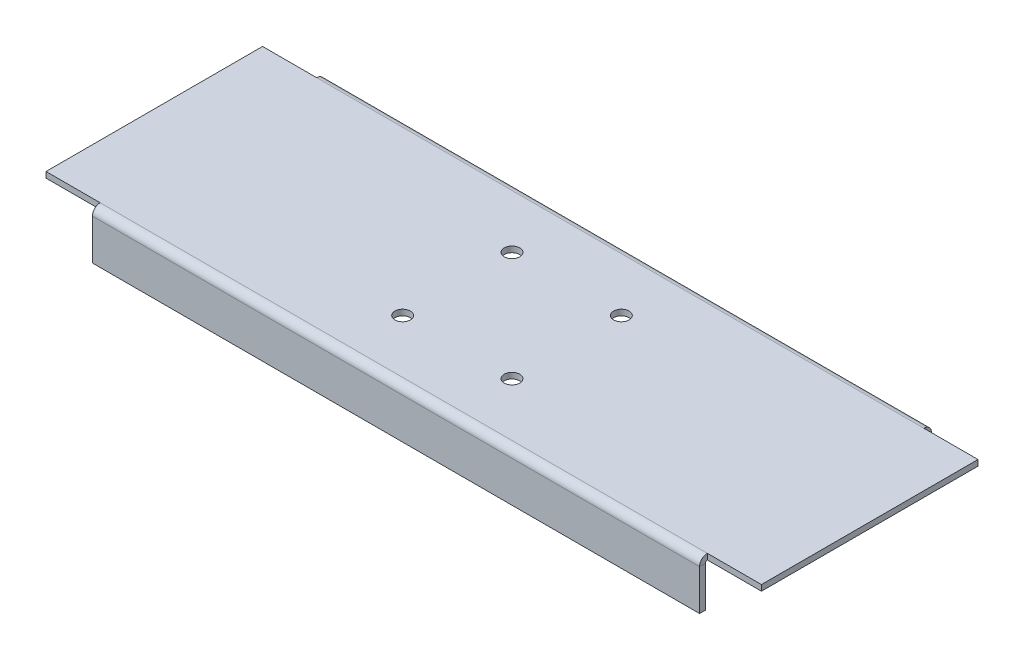
ISO-10303-21;
HEADER;
FILE_DESCRIPTION(('STEP AP214'),'2;1');
FILE_NAME('part.step','',(''),(''),'','','');
FILE_SCHEMA(('AUTOMOTIVE_DESIGN { 1 0 10303 214 1 1 1 1 }'));
ENDSEC;
DATA;
#1=APPLICATION_CONTEXT('core data for automotive mechanical design processes');
#2=APPLICATION_PROTOCOL_DEFINITION('international standard','automotive_design',2000,#1);
#3=PRODUCT_CONTEXT('',#1,'mechanical');
#4=PRODUCT('Part','Part','',(#3));
#5=PRODUCT_RELATED_PRODUCT_CATEGORY('part','',(#4));
#6=PRODUCT_DEFINITION_FORMATION('','',#4);
#7=PRODUCT_DEFINITION_CONTEXT('part definition',#1,'design');
#8=PRODUCT_DEFINITION('design','',#6,#7);
#9=PRODUCT_DEFINITION_SHAPE('','',#8);
#10=(LENGTH_UNIT() NAMED_UNIT(*) SI_UNIT(.MILLI.,.METRE.));
#11=(NAMED_UNIT(*) PLANE_ANGLE_UNIT() SI_UNIT($,.RADIAN.));
#12=(NAMED_UNIT(*) SI_UNIT($,.STERADIAN.) SOLID_ANGLE_UNIT());
#13=UNCERTAINTY_MEASURE_WITH_UNIT(LENGTH_MEASURE(1.E-05),#10,'distance_accuracy_value','');
#14=(GEOMETRIC_REPRESENTATION_CONTEXT(3) GLOBAL_UNCERTAINTY_ASSIGNED_CONTEXT((#13)) GLOBAL_UNIT_ASSIGNED_CONTEXT((#10,
#11,#12)) REPRESENTATION_CONTEXT('',''));
#15=CARTESIAN_POINT('',(0.,0.,0.));
#16=DIRECTION('',(0.,0.,1.));
#17=DIRECTION('',(1.,0.,0.));
#18=AXIS2_PLACEMENT_3D('',#15,#16,#17);
#19=CARTESIAN_POINT('',(-185.,-1.,56.));
#20=DIRECTION('',(-1.,0.,0.));
#21=DIRECTION('',(0.,0.,1.));
#22=AXIS2_PLACEMENT_3D('',#19,#20,#21);
#23=CYLINDRICAL_SURFACE('',#22,3.99999999999999);
#24=DIRECTION('',(-1.,0.,0.));
#25=VECTOR('',#24,1.);
#26=CARTESIAN_POINT('',(-185.,2.99999999999999,56.));
#27=LINE('',#26,#25);
#28=CARTESIAN_POINT('',(-157.,2.99999999999999,56.));
#29=VERTEX_POINT('',#28);
#30=CARTESIAN_POINT('',(157.,2.99999999999999,56.));
#31=VERTEX_POINT('',#30);
#32=EDGE_CURVE('E185',#29,#31,#27,.F.);
#33=ORIENTED_EDGE('',*,*,#32,.F.);
#34=CARTESIAN_POINT('',(-157.,-1.00000000000001,56.));
#35=DIRECTION('',(1.,0.,0.));
#36=DIRECTION('',(0.,0.,-1.));
#37=AXIS2_PLACEMENT_3D('',#34,#35,#36);
#38=CIRCLE('',#37,4.);
#39=CARTESIAN_POINT('',(-157.,-1.00000000000004,60.));
#40=VERTEX_POINT('',#39);
#41=EDGE_CURVE('E330',#29,#40,#38,.T.);
#42=ORIENTED_EDGE('',*,*,#41,.T.);
#43=DIRECTION('',(-1.,0.,0.));
#44=VECTOR('',#43,1.);
#45=CARTESIAN_POINT('',(0.,-1.,60.));
#46=LINE('',#45,#44);
#47=CARTESIAN_POINT('',(157.,-0.999999999999995,60.));
#48=VERTEX_POINT('',#47);
#49=EDGE_CURVE('E168',#48,#40,#46,.T.);
#50=ORIENTED_EDGE('',*,*,#49,.F.);
#51=CARTESIAN_POINT('',(157.,-1.00000000000001,56.));
#52=DIRECTION('',(-1.,0.,0.));
#53=DIRECTION('',(0.,0.,1.));
#54=AXIS2_PLACEMENT_3D('',#51,#52,#53);
#55=CIRCLE('',#54,4.);
#56=EDGE_CURVE('E383',#48,#31,#55,.T.);
#57=ORIENTED_EDGE('',*,*,#56,.T.);
#58=EDGE_LOOP('',(#33,#42,#50,#57));
#59=FACE_BOUND('',#58,.T.);
#60=ADVANCED_FACE('F38',(#59),#23,.T.);
#61=CARTESIAN_POINT('',(-185.,-1.,56.));
#62=DIRECTION('',(-1.,0.,0.));
#63=DIRECTION('',(0.,0.,1.));
#64=AXIS2_PLACEMENT_3D('',#61,#62,#63);
#65=CYLINDRICAL_SURFACE('',#64,0.999999999999994);
#66=CARTESIAN_POINT('',(-157.,-1.00000000000001,56.));
#67=DIRECTION('',(1.,0.,0.));
#68=DIRECTION('',(0.,0.,-1.));
#69=AXIS2_PLACEMENT_3D('',#66,#67,#68);
#70=CIRCLE('',#69,1.);
#71=CARTESIAN_POINT('',(-157.,0.,56.));
#72=VERTEX_POINT('',#71);
#73=CARTESIAN_POINT('',(-157.,-1.00000000000004,57.));
#74=VERTEX_POINT('',#73);
#75=EDGE_CURVE('E315',#72,#74,#70,.T.);
#76=ORIENTED_EDGE('',*,*,#75,.F.);
#77=DIRECTION('',(-1.,0.,0.));
#78=VECTOR('',#77,1.);
#79=CARTESIAN_POINT('',(-185.,0.,56.));
#80=LINE('',#79,#78);
#81=CARTESIAN_POINT('',(157.,0.,56.));
#82=VERTEX_POINT('',#81);
#83=EDGE_CURVE('E172',#72,#82,#80,.F.);
#84=ORIENTED_EDGE('',*,*,#83,.T.);
#85=CARTESIAN_POINT('',(157.,-1.00000000000001,56.));
#86=DIRECTION('',(1.,0.,0.));
#87=DIRECTION('',(0.,0.,-1.));
#88=AXIS2_PLACEMENT_3D('',#85,#86,#87);
#89=CIRCLE('',#88,1.);
#90=CARTESIAN_POINT('',(157.,-0.999999999999995,57.));
#91=VERTEX_POINT('',#90);
#92=EDGE_CURVE('E317',#91,#82,#89,.F.);
#93=ORIENTED_EDGE('',*,*,#92,.F.);
#94=DIRECTION('',(-1.,0.,0.));
#95=VECTOR('',#94,1.);
#96=CARTESIAN_POINT('',(185.,-0.999999999999994,57.));
#97=LINE('',#96,#95);
#98=EDGE_CURVE('E309',#91,#74,#97,.T.);
#99=ORIENTED_EDGE('',*,*,#98,.T.);
#100=EDGE_LOOP('',(#76,#84,#93,#99));
#101=FACE_BOUND('',#100,.T.);
#102=ADVANCED_FACE('F241',(#101),#65,.F.);
#103=CARTESIAN_POINT('',(0.,2.08232920277885E-13,60.));
#104=DIRECTION('',(0.,0.,1.));
#105=DIRECTION('',(0.,-1.,0.));
#106=AXIS2_PLACEMENT_3D('',#103,#104,#105);
#107=PLANE('',#106);
#108=ORIENTED_EDGE('',*,*,#49,.T.);
#109=DIRECTION('',(0.,-1.,0.));
#110=VECTOR('',#109,1.);
#111=CARTESIAN_POINT('',(-157.,-11.5,60.));
#112=LINE('',#111,#110);
#113=CARTESIAN_POINT('',(-157.,-22.,60.0000000000001));
#114=VERTEX_POINT('',#113);
#115=EDGE_CURVE('E154',#114,#40,#112,.F.);
#116=ORIENTED_EDGE('',*,*,#115,.F.);
#117=DIRECTION('',(-1.,0.,0.));
#118=VECTOR('',#117,1.);
#119=CARTESIAN_POINT('',(-185.,-22.,60.0000000000001));
#120=LINE('',#119,#118);
#121=CARTESIAN_POINT('',(157.,-22.,60.0000000000001));
#122=VERTEX_POINT('',#121);
#123=EDGE_CURVE('E166',#122,#114,#120,.T.);
#124=ORIENTED_EDGE('',*,*,#123,.F.);
#125=DIRECTION('',(0.,-1.,0.));
#126=VECTOR('',#125,1.);
#127=CARTESIAN_POINT('',(157.,1.80411241501588E-13,60.));
#128=LINE('',#127,#126);
#129=EDGE_CURVE('E55',#48,#122,#128,.T.);
#130=ORIENTED_EDGE('',*,*,#129,.F.);
#131=EDGE_LOOP('',(#108,#116,#124,#130));
#132=FACE_BOUND('',#131,.T.);
#133=ADVANCED_FACE('F165',(#132),#107,.T.);
#134=CARTESIAN_POINT('',(0.,1.97758476261356E-13,57.));
#135=DIRECTION('',(0.,0.,1.));
#136=DIRECTION('',(0.,-1.,0.));
#137=AXIS2_PLACEMENT_3D('',#134,#135,#136);
#138=PLANE('',#137);
#139=DIRECTION('',(0.,1.,0.));
#140=VECTOR('',#139,1.);
#141=CARTESIAN_POINT('',(-157.,-22.,57.0000000000001));
#142=LINE('',#141,#140);
#143=CARTESIAN_POINT('',(-157.,-22.,57.0000000000001));
#144=VERTEX_POINT('',#143);
#145=EDGE_CURVE('E63',#144,#74,#142,.T.);
#146=ORIENTED_EDGE('',*,*,#145,.T.);
#147=ORIENTED_EDGE('',*,*,#98,.F.);
#148=DIRECTION('',(0.,-1.,0.));
#149=VECTOR('',#148,1.);
#150=CARTESIAN_POINT('',(157.,1.73472347597681E-13,57.));
#151=LINE('',#150,#149);
#152=CARTESIAN_POINT('',(157.,-22.,57.0000000000001));
#153=VERTEX_POINT('',#152);
#154=EDGE_CURVE('E321',#91,#153,#151,.T.);
#155=ORIENTED_EDGE('',*,*,#154,.T.);
#156=DIRECTION('',(-1.,0.,0.));
#157=VECTOR('',#156,1.);
#158=CARTESIAN_POINT('',(-185.,-22.,57.0000000000001));
#159=LINE('',#158,#157);
#160=EDGE_CURVE('E173',#153,#144,#159,.T.);
#161=ORIENTED_EDGE('',*,*,#160,.T.);
#162=EDGE_LOOP('',(#146,#147,#155,#161));
#163=FACE_BOUND('',#162,.T.);
#164=ADVANCED_FACE('F320',(#163),#138,.F.);
#165=CARTESIAN_POINT('',(-185.,-22.,60.0000000000001));
#166=DIRECTION('',(0.,-1.,0.));
#167=DIRECTION('',(0.,0.,-1.));
#168=AXIS2_PLACEMENT_3D('',#165,#166,#167);
#169=PLANE('',#168);
#170=ORIENTED_EDGE('',*,*,#123,.T.);
#171=DIRECTION('',(0.,0.,1.));
#172=VECTOR('',#171,1.);
#173=CARTESIAN_POINT('',(-157.,-22.,57.0000000000001));
#174=LINE('',#173,#172);
#175=EDGE_CURVE('E151',#114,#144,#174,.F.);
#176=ORIENTED_EDGE('',*,*,#175,.T.);
#177=ORIENTED_EDGE('',*,*,#160,.F.);
#178=DIRECTION('',(0.,0.,-1.));
#179=VECTOR('',#178,1.);
#180=CARTESIAN_POINT('',(157.,-22.,57.0000000000001));
#181=LINE('',#180,#179);
#182=EDGE_CURVE('E171',#153,#122,#181,.F.);
#183=ORIENTED_EDGE('',*,*,#182,.T.);
#184=EDGE_LOOP('',(#170,#176,#177,#183));
#185=FACE_BOUND('',#184,.T.);
#186=ADVANCED_FACE('F170',(#185),#169,.T.);
#187=CARTESIAN_POINT('',(185.,-0.999999999999994,-56.));
#188=DIRECTION('',(1.,0.,0.));
#189=DIRECTION('',(0.,0.,-1.));
#190=AXIS2_PLACEMENT_3D('',#187,#188,#189);
#191=CYLINDRICAL_SURFACE('',#190,3.99999999999999);
#192=DIRECTION('',(1.,0.,0.));
#193=VECTOR('',#192,1.);
#194=CARTESIAN_POINT('',(185.,3.,-56.));
#195=LINE('',#194,#193);
#196=CARTESIAN_POINT('',(157.,3.,-56.));
#197=VERTEX_POINT('',#196);
#198=CARTESIAN_POINT('',(-157.,3.,-56.));
#199=VERTEX_POINT('',#198);
#200=EDGE_CURVE('E292',#197,#199,#195,.F.);
#201=ORIENTED_EDGE('',*,*,#200,.F.);
#202=CARTESIAN_POINT('',(157.,-1.,-56.));
#203=DIRECTION('',(-1.,0.,0.));
#204=DIRECTION('',(0.,0.,1.));
#205=AXIS2_PLACEMENT_3D('',#202,#203,#204);
#206=CIRCLE('',#205,4.);
#207=CARTESIAN_POINT('',(157.,-1.00000000000003,-60.));
#208=VERTEX_POINT('',#207);
#209=EDGE_CURVE('E343',#197,#208,#206,.T.);
#210=ORIENTED_EDGE('',*,*,#209,.T.);
#211=DIRECTION('',(1.,0.,0.));
#212=VECTOR('',#211,1.);
#213=CARTESIAN_POINT('',(0.,-0.999999999999966,-60.));
#214=LINE('',#213,#212);
#215=CARTESIAN_POINT('',(-157.,-0.999999999999972,-60.));
#216=VERTEX_POINT('',#215);
#217=EDGE_CURVE('E392',#216,#208,#214,.T.);
#218=ORIENTED_EDGE('',*,*,#217,.F.);
#219=CARTESIAN_POINT('',(-157.,-1.,-56.));
#220=DIRECTION('',(1.,0.,0.));
#221=DIRECTION('',(0.,0.,-1.));
#222=AXIS2_PLACEMENT_3D('',#219,#220,#221);
#223=CIRCLE('',#222,4.);
#224=EDGE_CURVE('E353',#216,#199,#223,.T.);
#225=ORIENTED_EDGE('',*,*,#224,.T.);
#226=EDGE_LOOP('',(#201,#210,#218,#225));
#227=FACE_BOUND('',#226,.T.);
#228=ADVANCED_FACE('F413',(#227),#191,.T.);
#229=CARTESIAN_POINT('',(185.,-0.999999999999994,-56.));
#230=DIRECTION('',(1.,0.,0.));
#231=DIRECTION('',(0.,0.,-1.));
#232=AXIS2_PLACEMENT_3D('',#229,#230,#231);
#233=CYLINDRICAL_SURFACE('',#232,0.999999999999994);
#234=CARTESIAN_POINT('',(157.,-1.,-56.));
#235=DIRECTION('',(-1.,0.,0.));
#236=DIRECTION('',(0.,0.,1.));
#237=AXIS2_PLACEMENT_3D('',#234,#235,#236);
#238=CIRCLE('',#237,1.);
#239=CARTESIAN_POINT('',(157.,0.,-56.));
#240=VERTEX_POINT('',#239);
#241=CARTESIAN_POINT('',(157.,-1.00000000000004,-57.));
#242=VERTEX_POINT('',#241);
#243=EDGE_CURVE('E366',#240,#242,#238,.T.);
#244=ORIENTED_EDGE('',*,*,#243,.F.);
#245=DIRECTION('',(1.,0.,0.));
#246=VECTOR('',#245,1.);
#247=CARTESIAN_POINT('',(185.,0.,-56.));
#248=LINE('',#247,#246);
#249=CARTESIAN_POINT('',(-157.,0.,-56.));
#250=VERTEX_POINT('',#249);
#251=EDGE_CURVE('E308',#240,#250,#248,.F.);
#252=ORIENTED_EDGE('',*,*,#251,.T.);
#253=CARTESIAN_POINT('',(-157.,-1.,-56.));
#254=DIRECTION('',(-1.,0.,0.));
#255=DIRECTION('',(0.,0.,1.));
#256=AXIS2_PLACEMENT_3D('',#253,#254,#255);
#257=CIRCLE('',#256,1.);
#258=CARTESIAN_POINT('',(-157.,-0.999999999999993,-57.));
#259=VERTEX_POINT('',#258);
#260=EDGE_CURVE('E351',#259,#250,#257,.F.);
#261=ORIENTED_EDGE('',*,*,#260,.F.);
#262=DIRECTION('',(1.,0.,0.));
#263=VECTOR('',#262,1.);
#264=CARTESIAN_POINT('',(-185.,-0.999999999999994,-57.));
#265=LINE('',#264,#263);
#266=EDGE_CURVE('E389',#259,#242,#265,.T.);
#267=ORIENTED_EDGE('',*,*,#266,.T.);
#268=EDGE_LOOP('',(#244,#252,#261,#267));
#269=FACE_BOUND('',#268,.T.);
#270=ADVANCED_FACE('F420',(#269),#233,.F.);
#271=CARTESIAN_POINT('',(0.,2.08232920277885E-13,-60.));
#272=DIRECTION('',(0.,0.,-1.));
#273=DIRECTION('',(0.,1.,0.));
#274=AXIS2_PLACEMENT_3D('',#271,#272,#273);
#275=PLANE('',#274);
#276=ORIENTED_EDGE('',*,*,#217,.T.);
#277=DIRECTION('',(0.,1.,0.));
#278=VECTOR('',#277,1.);
#279=CARTESIAN_POINT('',(157.,-11.5,-60.));
#280=LINE('',#279,#278);
#281=CARTESIAN_POINT('',(157.,-22.,-60.0000000000001));
#282=VERTEX_POINT('',#281);
#283=EDGE_CURVE('E328',#282,#208,#280,.T.);
#284=ORIENTED_EDGE('',*,*,#283,.F.);
#285=DIRECTION('',(1.,0.,0.));
#286=VECTOR('',#285,1.);
#287=CARTESIAN_POINT('',(185.,-22.,-60.0000000000001));
#288=LINE('',#287,#286);
#289=CARTESIAN_POINT('',(-157.,-22.,-60.0000000000001));
#290=VERTEX_POINT('',#289);
#291=EDGE_CURVE('E394',#290,#282,#288,.T.);
#292=ORIENTED_EDGE('',*,*,#291,.F.);
#293=DIRECTION('',(0.,1.,0.));
#294=VECTOR('',#293,1.);
#295=CARTESIAN_POINT('',(-157.,1.73472347597681E-13,-60.));
#296=LINE('',#295,#294);
#297=EDGE_CURVE('E362',#216,#290,#296,.F.);
#298=ORIENTED_EDGE('',*,*,#297,.F.);
#299=EDGE_LOOP('',(#276,#284,#292,#298));
#300=FACE_BOUND('',#299,.T.);
#301=ADVANCED_FACE('F409',(#300),#275,.T.);
#302=CARTESIAN_POINT('',(0.,1.97758476261356E-13,-57.));
#303=DIRECTION('',(0.,0.,-1.));
#304=DIRECTION('',(0.,1.,0.));
#305=AXIS2_PLACEMENT_3D('',#302,#303,#304);
#306=PLANE('',#305);
#307=DIRECTION('',(0.,1.,0.));
#308=VECTOR('',#307,1.);
#309=CARTESIAN_POINT('',(157.,-22.0000000000002,-57.0000000000001));
#310=LINE('',#309,#308);
#311=CARTESIAN_POINT('',(157.,-22.,-57.0000000000001));
#312=VERTEX_POINT('',#311);
#313=EDGE_CURVE('E324',#312,#242,#310,.T.);
#314=ORIENTED_EDGE('',*,*,#313,.T.);
#315=ORIENTED_EDGE('',*,*,#266,.F.);
#316=DIRECTION('',(0.,-1.,0.));
#317=VECTOR('',#316,1.);
#318=CARTESIAN_POINT('',(-157.,1.66533453693773E-13,-57.));
#319=LINE('',#318,#317);
#320=CARTESIAN_POINT('',(-157.,-22.,-57.0000000000001));
#321=VERTEX_POINT('',#320);
#322=EDGE_CURVE('E359',#259,#321,#319,.T.);
#323=ORIENTED_EDGE('',*,*,#322,.T.);
#324=DIRECTION('',(1.,0.,0.));
#325=VECTOR('',#324,1.);
#326=CARTESIAN_POINT('',(185.,-22.,-57.0000000000001));
#327=LINE('',#326,#325);
#328=EDGE_CURVE('E304',#321,#312,#327,.T.);
#329=ORIENTED_EDGE('',*,*,#328,.T.);
#330=EDGE_LOOP('',(#314,#315,#323,#329));
#331=FACE_BOUND('',#330,.T.);
#332=ADVANCED_FACE('F402',(#331),#306,.F.);
#333=CARTESIAN_POINT('',(185.,-22.,-60.0000000000001));
#334=DIRECTION('',(0.,-1.,0.));
#335=DIRECTION('',(0.,0.,-1.));
#336=AXIS2_PLACEMENT_3D('',#333,#334,#335);
#337=PLANE('',#336);
#338=ORIENTED_EDGE('',*,*,#291,.T.);
#339=DIRECTION('',(0.,0.,-1.));
#340=VECTOR('',#339,1.);
#341=CARTESIAN_POINT('',(157.,-22.,-57.0000000000001));
#342=LINE('',#341,#340);
#343=EDGE_CURVE('E327',#282,#312,#342,.F.);
#344=ORIENTED_EDGE('',*,*,#343,.T.);
#345=ORIENTED_EDGE('',*,*,#328,.F.);
#346=DIRECTION('',(0.,0.,1.));
#347=VECTOR('',#346,1.);
#348=CARTESIAN_POINT('',(-157.,-22.,-57.0000000000001));
#349=LINE('',#348,#347);
#350=EDGE_CURVE('E356',#321,#290,#349,.F.);
#351=ORIENTED_EDGE('',*,*,#350,.T.);
#352=EDGE_LOOP('',(#338,#344,#345,#351));
#353=FACE_BOUND('',#352,.T.);
#354=ADVANCED_FACE('F256',(#353),#337,.T.);
#355=CARTESIAN_POINT('',(0.,3.,0.));
#356=DIRECTION('',(0.,-1.,0.));
#357=DIRECTION('',(0.,0.,-1.));
#358=AXIS2_PLACEMENT_3D('',#355,#356,#357);
#359=PLANE('',#358);
#360=CARTESIAN_POINT('',(-28.2842712474619,3.,-28.2842712474619));
#361=DIRECTION('',(0.,1.,0.));
#362=DIRECTION('',(0.,0.,1.));
#363=AXIS2_PLACEMENT_3D('',#360,#361,#362);
#364=CIRCLE('',#363,4.);
#365=CARTESIAN_POINT('',(-28.2842712474619,3.,-24.2842712474619));
#366=VERTEX_POINT('',#365);
#367=EDGE_CURVE('E199',#366,#366,#364,.T.);
#368=ORIENTED_EDGE('',*,*,#367,.F.);
#369=EDGE_LOOP('',(#368));
#370=FACE_BOUND('',#369,.T.);
#371=CARTESIAN_POINT('',(28.2842712474618,3.,-28.2842712474619));
#372=DIRECTION('',(0.,1.,0.));
#373=DIRECTION('',(0.,0.,1.));
#374=AXIS2_PLACEMENT_3D('',#371,#372,#373);
#375=CIRCLE('',#374,4.);
#376=CARTESIAN_POINT('',(28.2842712474618,3.,-24.2842712474619));
#377=VERTEX_POINT('',#376);
#378=EDGE_CURVE('E202',#377,#377,#375,.T.);
#379=ORIENTED_EDGE('',*,*,#378,.F.);
#380=EDGE_LOOP('',(#379));
#381=FACE_BOUND('',#380,.T.);
#382=CARTESIAN_POINT('',(28.2842712474618,3.,28.2842712474619));
#383=DIRECTION('',(0.,1.,0.));
#384=DIRECTION('',(0.,0.,1.));
#385=AXIS2_PLACEMENT_3D('',#382,#383,#384);
#386=CIRCLE('',#385,4.);
#387=CARTESIAN_POINT('',(28.2842712474618,3.,32.2842712474619));
#388=VERTEX_POINT('',#387);
#389=EDGE_CURVE('E47',#388,#388,#386,.T.);
#390=ORIENTED_EDGE('',*,*,#389,.F.);
#391=EDGE_LOOP('',(#390));
#392=FACE_BOUND('',#391,.T.);
#393=CARTESIAN_POINT('',(-28.2842712474619,3.,28.2842712474619));
#394=DIRECTION('',(0.,1.,0.));
#395=DIRECTION('',(0.,0.,1.));
#396=AXIS2_PLACEMENT_3D('',#393,#394,#395);
#397=CIRCLE('',#396,4.);
#398=CARTESIAN_POINT('',(-28.2842712474619,3.,32.2842712474619));
#399=VERTEX_POINT('',#398);
#400=EDGE_CURVE('E11',#399,#399,#397,.T.);
#401=ORIENTED_EDGE('',*,*,#400,.F.);
#402=EDGE_LOOP('',(#401));
#403=FACE_BOUND('',#402,.T.);
#404=CARTESIAN_POINT('',(185.,3.,-56.));
#405=VERTEX_POINT('',#404);
#406=EDGE_CURVE('E289',#405,#197,#195,.F.);
#407=ORIENTED_EDGE('',*,*,#406,.T.);
#408=ORIENTED_EDGE('',*,*,#200,.T.);
#409=DIRECTION('',(1.,0.,0.));
#410=VECTOR('',#409,1.);
#411=CARTESIAN_POINT('',(185.,3.,-56.));
#412=LINE('',#411,#410);
#413=CARTESIAN_POINT('',(-185.,3.,-56.));
#414=VERTEX_POINT('',#413);
#415=EDGE_CURVE('E342',#199,#414,#412,.F.);
#416=ORIENTED_EDGE('',*,*,#415,.T.);
#417=DIRECTION('',(0.,0.,1.));
#418=VECTOR('',#417,1.);
#419=CARTESIAN_POINT('',(-185.,3.,57.));
#420=LINE('',#419,#418);
#421=CARTESIAN_POINT('',(-185.,2.99999999999999,56.));
#422=VERTEX_POINT('',#421);
#423=EDGE_CURVE('E196',#414,#422,#420,.T.);
#424=ORIENTED_EDGE('',*,*,#423,.T.);
#425=EDGE_CURVE('E182',#422,#29,#27,.F.);
#426=ORIENTED_EDGE('',*,*,#425,.T.);
#427=ORIENTED_EDGE('',*,*,#32,.T.);
#428=DIRECTION('',(-1.,0.,0.));
#429=VECTOR('',#428,1.);
#430=CARTESIAN_POINT('',(-185.,2.99999999999999,56.));
#431=LINE('',#430,#429);
#432=CARTESIAN_POINT('',(185.,3.,56.));
#433=VERTEX_POINT('',#432);
#434=EDGE_CURVE('E374',#31,#433,#431,.F.);
#435=ORIENTED_EDGE('',*,*,#434,.T.);
#436=DIRECTION('',(0.,0.,-1.));
#437=VECTOR('',#436,1.);
#438=CARTESIAN_POINT('',(185.,3.,57.));
#439=LINE('',#438,#437);
#440=EDGE_CURVE('E193',#433,#405,#439,.T.);
#441=ORIENTED_EDGE('',*,*,#440,.T.);
#442=EDGE_LOOP('',(#407,#408,#416,#424,#426,#427,#435,#441));
#443=FACE_BOUND('',#442,.T.);
#444=ADVANCED_FACE('F253',(#370,#381,#392,#403,#443),#359,.F.);
#445=CARTESIAN_POINT('',(0.,0.,0.));
#446=DIRECTION('',(0.,-1.,0.));
#447=DIRECTION('',(0.,0.,-1.));
#448=AXIS2_PLACEMENT_3D('',#445,#446,#447);
#449=PLANE('',#448);
#450=CARTESIAN_POINT('',(-28.2842712474619,0.,-28.2842712474619));
#451=DIRECTION('',(0.,1.,0.));
#452=DIRECTION('',(0.,0.,1.));
#453=AXIS2_PLACEMENT_3D('',#450,#451,#452);
#454=CIRCLE('',#453,4.);
#455=CARTESIAN_POINT('',(-28.2842712474619,0.,-24.2842712474619));
#456=VERTEX_POINT('',#455);
#457=EDGE_CURVE('E212',#456,#456,#454,.T.);
#458=ORIENTED_EDGE('',*,*,#457,.T.);
#459=EDGE_LOOP('',(#458));
#460=FACE_BOUND('',#459,.T.);
#461=CARTESIAN_POINT('',(28.2842712474618,0.,-28.2842712474619));
#462=DIRECTION('',(0.,1.,0.));
#463=DIRECTION('',(0.,0.,1.));
#464=AXIS2_PLACEMENT_3D('',#461,#462,#463);
#465=CIRCLE('',#464,4.);
#466=CARTESIAN_POINT('',(28.2842712474618,0.,-24.2842712474619));
#467=VERTEX_POINT('',#466);
#468=EDGE_CURVE('E215',#467,#467,#465,.T.);
#469=ORIENTED_EDGE('',*,*,#468,.T.);
#470=EDGE_LOOP('',(#469));
#471=FACE_BOUND('',#470,.T.);
#472=CARTESIAN_POINT('',(28.2842712474618,0.,28.2842712474619));
#473=DIRECTION('',(0.,1.,0.));
#474=DIRECTION('',(0.,0.,1.));
#475=AXIS2_PLACEMENT_3D('',#472,#473,#474);
#476=CIRCLE('',#475,4.);
#477=CARTESIAN_POINT('',(28.2842712474618,0.,32.2842712474619));
#478=VERTEX_POINT('',#477);
#479=EDGE_CURVE('E217',#478,#478,#476,.T.);
#480=ORIENTED_EDGE('',*,*,#479,.T.);
#481=EDGE_LOOP('',(#480));
#482=FACE_BOUND('',#481,.T.);
#483=CARTESIAN_POINT('',(-28.2842712474619,0.,28.2842712474619));
#484=DIRECTION('',(0.,1.,0.));
#485=DIRECTION('',(0.,0.,1.));
#486=AXIS2_PLACEMENT_3D('',#483,#484,#485);
#487=CIRCLE('',#486,4.);
#488=CARTESIAN_POINT('',(-28.2842712474619,0.,32.2842712474619));
#489=VERTEX_POINT('',#488);
#490=EDGE_CURVE('E42',#489,#489,#487,.T.);
#491=ORIENTED_EDGE('',*,*,#490,.T.);
#492=EDGE_LOOP('',(#491));
#493=FACE_BOUND('',#492,.T.);
#494=DIRECTION('',(0.,0.,-1.));
#495=VECTOR('',#494,1.);
#496=CARTESIAN_POINT('',(-185.,0.,0.));
#497=LINE('',#496,#495);
#498=CARTESIAN_POINT('',(-185.,0.,-56.));
#499=VERTEX_POINT('',#498);
#500=CARTESIAN_POINT('',(-185.,0.,56.));
#501=VERTEX_POINT('',#500);
#502=EDGE_CURVE('E209',#499,#501,#497,.F.);
#503=ORIENTED_EDGE('',*,*,#502,.F.);
#504=DIRECTION('',(1.,0.,0.));
#505=VECTOR('',#504,1.);
#506=CARTESIAN_POINT('',(185.,0.,-56.));
#507=LINE('',#506,#505);
#508=EDGE_CURVE('E340',#250,#499,#507,.F.);
#509=ORIENTED_EDGE('',*,*,#508,.F.);
#510=ORIENTED_EDGE('',*,*,#251,.F.);
#511=CARTESIAN_POINT('',(185.,0.,-56.));
#512=VERTEX_POINT('',#511);
#513=EDGE_CURVE('E301',#512,#240,#248,.F.);
#514=ORIENTED_EDGE('',*,*,#513,.F.);
#515=DIRECTION('',(0.,0.,-1.));
#516=VECTOR('',#515,1.);
#517=CARTESIAN_POINT('',(185.,0.,0.));
#518=LINE('',#517,#516);
#519=CARTESIAN_POINT('',(185.,0.,56.));
#520=VERTEX_POINT('',#519);
#521=EDGE_CURVE('E190',#520,#512,#518,.T.);
#522=ORIENTED_EDGE('',*,*,#521,.F.);
#523=DIRECTION('',(-1.,0.,0.));
#524=VECTOR('',#523,1.);
#525=CARTESIAN_POINT('',(-185.,0.,56.));
#526=LINE('',#525,#524);
#527=EDGE_CURVE('E364',#82,#520,#526,.F.);
#528=ORIENTED_EDGE('',*,*,#527,.F.);
#529=ORIENTED_EDGE('',*,*,#83,.F.);
#530=EDGE_CURVE('E176',#501,#72,#80,.F.);
#531=ORIENTED_EDGE('',*,*,#530,.F.);
#532=EDGE_LOOP('',(#503,#509,#510,#514,#522,#528,#529,#531));
#533=FACE_BOUND('',#532,.T.);
#534=ADVANCED_FACE('F224',(#460,#471,#482,#493,#533),#449,.T.);
#535=CARTESIAN_POINT('',(185.,3.,57.));
#536=DIRECTION('',(-1.,0.,0.));
#537=DIRECTION('',(0.,0.,-1.));
#538=AXIS2_PLACEMENT_3D('',#535,#536,#537);
#539=PLANE('',#538);
#540=ORIENTED_EDGE('',*,*,#521,.T.);
#541=DIRECTION('',(0.,1.,0.));
#542=VECTOR('',#541,1.);
#543=CARTESIAN_POINT('',(185.,0.,-56.));
#544=LINE('',#543,#542);
#545=EDGE_CURVE('E297',#512,#405,#544,.T.);
#546=ORIENTED_EDGE('',*,*,#545,.T.);
#547=ORIENTED_EDGE('',*,*,#440,.F.);
#548=DIRECTION('',(0.,1.,0.));
#549=VECTOR('',#548,1.);
#550=CARTESIAN_POINT('',(185.,0.,56.));
#551=LINE('',#550,#549);
#552=EDGE_CURVE('E188',#520,#433,#551,.T.);
#553=ORIENTED_EDGE('',*,*,#552,.F.);
#554=EDGE_LOOP('',(#540,#546,#547,#553));
#555=FACE_BOUND('',#554,.T.);
#556=ADVANCED_FACE('F260',(#555),#539,.F.);
#557=CARTESIAN_POINT('',(-185.,3.,57.));
#558=DIRECTION('',(1.,0.,0.));
#559=DIRECTION('',(0.,0.,1.));
#560=AXIS2_PLACEMENT_3D('',#557,#558,#559);
#561=PLANE('',#560);
#562=DIRECTION('',(0.,1.,0.));
#563=VECTOR('',#562,1.);
#564=CARTESIAN_POINT('',(-185.,0.,-56.));
#565=LINE('',#564,#563);
#566=EDGE_CURVE('E299',#499,#414,#565,.T.);
#567=ORIENTED_EDGE('',*,*,#566,.F.);
#568=ORIENTED_EDGE('',*,*,#502,.T.);
#569=DIRECTION('',(0.,1.,0.));
#570=VECTOR('',#569,1.);
#571=CARTESIAN_POINT('',(-185.,0.,56.));
#572=LINE('',#571,#570);
#573=EDGE_CURVE('E184',#501,#422,#572,.T.);
#574=ORIENTED_EDGE('',*,*,#573,.T.);
#575=ORIENTED_EDGE('',*,*,#423,.F.);
#576=EDGE_LOOP('',(#567,#568,#574,#575));
#577=FACE_BOUND('',#576,.T.);
#578=ADVANCED_FACE('F264',(#577),#561,.F.);
#579=CARTESIAN_POINT('',(-28.2842712474619,3.,-28.2842712474619));
#580=DIRECTION('',(0.,-1.,0.));
#581=DIRECTION('',(0.,0.,-1.));
#582=AXIS2_PLACEMENT_3D('',#579,#580,#581);
#583=CYLINDRICAL_SURFACE('',#582,4.);
#584=ORIENTED_EDGE('',*,*,#367,.T.);
#585=EDGE_LOOP('',(#584));
#586=FACE_BOUND('',#585,.T.);
#587=ORIENTED_EDGE('',*,*,#457,.F.);
#588=EDGE_LOOP('',(#587));
#589=FACE_BOUND('',#588,.T.);
#590=ADVANCED_FACE('F268',(#586,#589),#583,.F.);
#591=CARTESIAN_POINT('',(28.2842712474618,3.,-28.2842712474619));
#592=DIRECTION('',(0.,-1.,0.));
#593=DIRECTION('',(0.,0.,-1.));
#594=AXIS2_PLACEMENT_3D('',#591,#592,#593);
#595=CYLINDRICAL_SURFACE('',#594,4.);
#596=ORIENTED_EDGE('',*,*,#378,.T.);
#597=EDGE_LOOP('',(#596));
#598=FACE_BOUND('',#597,.T.);
#599=ORIENTED_EDGE('',*,*,#468,.F.);
#600=EDGE_LOOP('',(#599));
#601=FACE_BOUND('',#600,.T.);
#602=ADVANCED_FACE('F238',(#598,#601),#595,.F.);
#603=CARTESIAN_POINT('',(28.2842712474618,3.,28.2842712474619));
#604=DIRECTION('',(0.,-1.,0.));
#605=DIRECTION('',(0.,0.,-1.));
#606=AXIS2_PLACEMENT_3D('',#603,#604,#605);
#607=CYLINDRICAL_SURFACE('',#606,4.);
#608=ORIENTED_EDGE('',*,*,#389,.T.);
#609=EDGE_LOOP('',(#608));
#610=FACE_BOUND('',#609,.T.);
#611=ORIENTED_EDGE('',*,*,#479,.F.);
#612=EDGE_LOOP('',(#611));
#613=FACE_BOUND('',#612,.T.);
#614=ADVANCED_FACE('F229',(#610,#613),#607,.F.);
#615=CARTESIAN_POINT('',(-28.2842712474619,3.,28.2842712474619));
#616=DIRECTION('',(0.,-1.,0.));
#617=DIRECTION('',(0.,0.,-1.));
#618=AXIS2_PLACEMENT_3D('',#615,#616,#617);
#619=CYLINDRICAL_SURFACE('',#618,4.);
#620=ORIENTED_EDGE('',*,*,#400,.T.);
#621=EDGE_LOOP('',(#620));
#622=FACE_BOUND('',#621,.T.);
#623=ORIENTED_EDGE('',*,*,#490,.F.);
#624=EDGE_LOOP('',(#623));
#625=FACE_BOUND('',#624,.T.);
#626=ADVANCED_FACE('F40',(#622,#625),#619,.F.);
#627=CARTESIAN_POINT('',(-157.,1.66533453693773E-13,-57.));
#628=DIRECTION('',(1.,0.,0.));
#629=DIRECTION('',(0.,-1.,0.));
#630=AXIS2_PLACEMENT_3D('',#627,#628,#629);
#631=PLANE('',#630);
#632=ORIENTED_EDGE('',*,*,#350,.F.);
#633=ORIENTED_EDGE('',*,*,#322,.F.);
#634=DIRECTION('',(0.,0.,1.));
#635=VECTOR('',#634,1.);
#636=CARTESIAN_POINT('',(-157.,-1.,-60.));
#637=LINE('',#636,#635);
#638=EDGE_CURVE('E348',#216,#259,#637,.T.);
#639=ORIENTED_EDGE('',*,*,#638,.F.);
#640=ORIENTED_EDGE('',*,*,#297,.T.);
#641=EDGE_LOOP('',(#632,#633,#639,#640));
#642=FACE_BOUND('',#641,.T.);
#643=ADVANCED_FACE('F228',(#642),#631,.F.);
#644=CARTESIAN_POINT('',(-157.,-1.,-56.));
#645=DIRECTION('',(-1.,0.,0.));
#646=DIRECTION('',(0.,0.,1.));
#647=AXIS2_PLACEMENT_3D('',#644,#645,#646);
#648=PLANE('',#647);
#649=ORIENTED_EDGE('',*,*,#638,.T.);
#650=ORIENTED_EDGE('',*,*,#260,.T.);
#651=DIRECTION('',(0.,1.,0.));
#652=VECTOR('',#651,1.);
#653=CARTESIAN_POINT('',(-157.,0.,-56.));
#654=LINE('',#653,#652);
#655=EDGE_CURVE('E345',#250,#199,#654,.T.);
#656=ORIENTED_EDGE('',*,*,#655,.T.);
#657=ORIENTED_EDGE('',*,*,#224,.F.);
#658=EDGE_LOOP('',(#649,#650,#656,#657));
#659=FACE_BOUND('',#658,.T.);
#660=ADVANCED_FACE('F235',(#659),#648,.T.);
#661=CARTESIAN_POINT('',(-171.,0.,-56.));
#662=DIRECTION('',(0.,0.,1.));
#663=DIRECTION('',(1.,0.,0.));
#664=AXIS2_PLACEMENT_3D('',#661,#662,#663);
#665=PLANE('',#664);
#666=ORIENTED_EDGE('',*,*,#508,.T.);
#667=ORIENTED_EDGE('',*,*,#566,.T.);
#668=ORIENTED_EDGE('',*,*,#415,.F.);
#669=ORIENTED_EDGE('',*,*,#655,.F.);
#670=EDGE_LOOP('',(#666,#667,#668,#669));
#671=FACE_BOUND('',#670,.T.);
#672=ADVANCED_FACE('F430',(#671),#665,.F.);
#673=CARTESIAN_POINT('',(157.,-1.,-56.));
#674=DIRECTION('',(1.,0.,0.));
#675=DIRECTION('',(0.,0.,-1.));
#676=AXIS2_PLACEMENT_3D('',#673,#674,#675);
#677=PLANE('',#676);
#678=DIRECTION('',(0.,1.,0.));
#679=VECTOR('',#678,1.);
#680=CARTESIAN_POINT('',(157.,0.,-56.));
#681=LINE('',#680,#679);
#682=EDGE_CURVE('E333',#240,#197,#681,.T.);
#683=ORIENTED_EDGE('',*,*,#682,.F.);
#684=ORIENTED_EDGE('',*,*,#243,.T.);
#685=DIRECTION('',(0.,0.,1.));
#686=VECTOR('',#685,1.);
#687=CARTESIAN_POINT('',(157.,-1.00000000000003,-60.));
#688=LINE('',#687,#686);
#689=EDGE_CURVE('E369',#208,#242,#688,.T.);
#690=ORIENTED_EDGE('',*,*,#689,.F.);
#691=ORIENTED_EDGE('',*,*,#209,.F.);
#692=EDGE_LOOP('',(#683,#684,#690,#691));
#693=FACE_BOUND('',#692,.T.);
#694=ADVANCED_FACE('F416',(#693),#677,.T.);
#695=CARTESIAN_POINT('',(171.,0.,-56.));
#696=DIRECTION('',(0.,0.,1.));
#697=DIRECTION('',(1.,0.,0.));
#698=AXIS2_PLACEMENT_3D('',#695,#696,#697);
#699=PLANE('',#698);
#700=ORIENTED_EDGE('',*,*,#545,.F.);
#701=ORIENTED_EDGE('',*,*,#513,.T.);
#702=ORIENTED_EDGE('',*,*,#682,.T.);
#703=ORIENTED_EDGE('',*,*,#406,.F.);
#704=EDGE_LOOP('',(#700,#701,#702,#703));
#705=FACE_BOUND('',#704,.T.);
#706=ADVANCED_FACE('F443',(#705),#699,.F.);
#707=CARTESIAN_POINT('',(157.,-22.0000000000002,-57.0000000000001));
#708=DIRECTION('',(-1.,0.,0.));
#709=DIRECTION('',(0.,1.,0.));
#710=AXIS2_PLACEMENT_3D('',#707,#708,#709);
#711=PLANE('',#710);
#712=ORIENTED_EDGE('',*,*,#283,.T.);
#713=ORIENTED_EDGE('',*,*,#689,.T.);
#714=ORIENTED_EDGE('',*,*,#313,.F.);
#715=ORIENTED_EDGE('',*,*,#343,.F.);
#716=EDGE_LOOP('',(#712,#713,#714,#715));
#717=FACE_BOUND('',#716,.T.);
#718=ADVANCED_FACE('F406',(#717),#711,.F.);
#719=CARTESIAN_POINT('',(157.,1.73472347597681E-13,57.));
#720=DIRECTION('',(-1.,0.,0.));
#721=DIRECTION('',(0.,-1.,0.));
#722=AXIS2_PLACEMENT_3D('',#719,#720,#721);
#723=PLANE('',#722);
#724=ORIENTED_EDGE('',*,*,#182,.F.);
#725=ORIENTED_EDGE('',*,*,#154,.F.);
#726=DIRECTION('',(0.,0.,-1.));
#727=VECTOR('',#726,1.);
#728=CARTESIAN_POINT('',(157.,-1.00000000000003,60.));
#729=LINE('',#728,#727);
#730=EDGE_CURVE('E379',#48,#91,#729,.T.);
#731=ORIENTED_EDGE('',*,*,#730,.F.);
#732=ORIENTED_EDGE('',*,*,#129,.T.);
#733=EDGE_LOOP('',(#724,#725,#731,#732));
#734=FACE_BOUND('',#733,.T.);
#735=ADVANCED_FACE('F456',(#734),#723,.F.);
#736=CARTESIAN_POINT('',(157.,-1.00000000000001,56.));
#737=DIRECTION('',(1.,0.,0.));
#738=DIRECTION('',(0.,0.,-1.));
#739=AXIS2_PLACEMENT_3D('',#736,#737,#738);
#740=PLANE('',#739);
#741=ORIENTED_EDGE('',*,*,#730,.T.);
#742=ORIENTED_EDGE('',*,*,#92,.T.);
#743=DIRECTION('',(0.,1.,0.));
#744=VECTOR('',#743,1.);
#745=CARTESIAN_POINT('',(157.,0.,56.));
#746=LINE('',#745,#744);
#747=EDGE_CURVE('E376',#82,#31,#746,.T.);
#748=ORIENTED_EDGE('',*,*,#747,.T.);
#749=ORIENTED_EDGE('',*,*,#56,.F.);
#750=EDGE_LOOP('',(#741,#742,#748,#749));
#751=FACE_BOUND('',#750,.T.);
#752=ADVANCED_FACE('F452',(#751),#740,.T.);
#753=CARTESIAN_POINT('',(171.,0.,56.));
#754=DIRECTION('',(0.,0.,-1.));
#755=DIRECTION('',(-1.,0.,0.));
#756=AXIS2_PLACEMENT_3D('',#753,#754,#755);
#757=PLANE('',#756);
#758=ORIENTED_EDGE('',*,*,#527,.T.);
#759=ORIENTED_EDGE('',*,*,#552,.T.);
#760=ORIENTED_EDGE('',*,*,#434,.F.);
#761=ORIENTED_EDGE('',*,*,#747,.F.);
#762=EDGE_LOOP('',(#758,#759,#760,#761));
#763=FACE_BOUND('',#762,.T.);
#764=ADVANCED_FACE('F448',(#763),#757,.F.);
#765=CARTESIAN_POINT('',(-157.,-1.00000000000001,56.));
#766=DIRECTION('',(-1.,0.,0.));
#767=DIRECTION('',(0.,0.,1.));
#768=AXIS2_PLACEMENT_3D('',#765,#766,#767);
#769=PLANE('',#768);
#770=DIRECTION('',(0.,1.,0.));
#771=VECTOR('',#770,1.);
#772=CARTESIAN_POINT('',(-157.,0.,56.));
#773=LINE('',#772,#771);
#774=EDGE_CURVE('E160',#72,#29,#773,.T.);
#775=ORIENTED_EDGE('',*,*,#774,.F.);
#776=ORIENTED_EDGE('',*,*,#75,.T.);
#777=DIRECTION('',(0.,0.,-1.));
#778=VECTOR('',#777,1.);
#779=CARTESIAN_POINT('',(-157.,-1.00000000000004,60.));
#780=LINE('',#779,#778);
#781=EDGE_CURVE('E336',#40,#74,#780,.T.);
#782=ORIENTED_EDGE('',*,*,#781,.F.);
#783=ORIENTED_EDGE('',*,*,#41,.F.);
#784=EDGE_LOOP('',(#775,#776,#782,#783));
#785=FACE_BOUND('',#784,.T.);
#786=ADVANCED_FACE('F451',(#785),#769,.T.);
#787=CARTESIAN_POINT('',(-171.,0.,56.));
#788=DIRECTION('',(0.,0.,-1.));
#789=DIRECTION('',(-1.,0.,0.));
#790=AXIS2_PLACEMENT_3D('',#787,#788,#789);
#791=PLANE('',#790);
#792=ORIENTED_EDGE('',*,*,#573,.F.);
#793=ORIENTED_EDGE('',*,*,#530,.T.);
#794=ORIENTED_EDGE('',*,*,#774,.T.);
#795=ORIENTED_EDGE('',*,*,#425,.F.);
#796=EDGE_LOOP('',(#792,#793,#794,#795));
#797=FACE_BOUND('',#796,.T.);
#798=ADVANCED_FACE('F689',(#797),#791,.F.);
#799=CARTESIAN_POINT('',(-157.,-22.,57.0000000000001));
#800=DIRECTION('',(1.,0.,0.));
#801=DIRECTION('',(0.,1.,0.));
#802=AXIS2_PLACEMENT_3D('',#799,#800,#801);
#803=PLANE('',#802);
#804=ORIENTED_EDGE('',*,*,#115,.T.);
#805=ORIENTED_EDGE('',*,*,#781,.T.);
#806=ORIENTED_EDGE('',*,*,#145,.F.);
#807=ORIENTED_EDGE('',*,*,#175,.F.);
#808=EDGE_LOOP('',(#804,#805,#806,#807));
#809=FACE_BOUND('',#808,.T.);
#810=ADVANCED_FACE('F153',(#809),#803,.F.);
#811=CLOSED_SHELL('',(#60,#102,#133,#164,#186,#228,#270,#301,#332,#354,#444,#534,#556,#578,#590,
#602,#614,#626,#643,#660,#672,#694,#706,#718,#735,#752,#764,#786,#798,#810));
#812=MANIFOLD_SOLID_BREP('B2',#811);
#813=ADVANCED_BREP_SHAPE_REPRESENTATION('',(#18,#812),#14);
#814=SHAPE_DEFINITION_REPRESENTATION(#9,#813);
ENDSEC;
END-ISO-10303-21;
